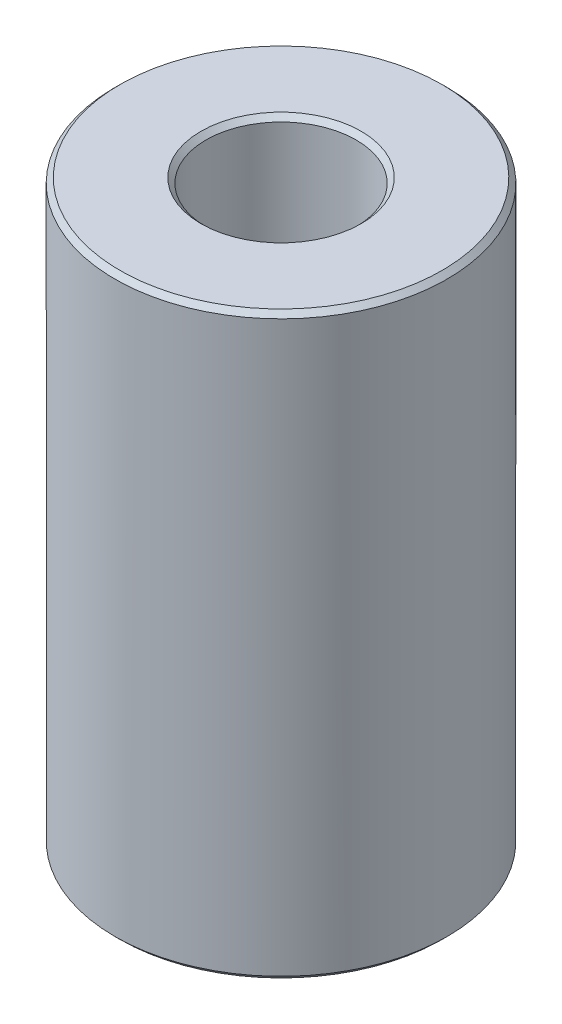
ISO-10303-21;
HEADER;
FILE_DESCRIPTION(('STEP AP214'),'2;1');
FILE_NAME('part.step','',(''),(''),'','','');
FILE_SCHEMA(('AUTOMOTIVE_DESIGN { 1 0 10303 214 1 1 1 1 }'));
ENDSEC;
DATA;
#1=APPLICATION_CONTEXT('core data for automotive mechanical design processes');
#2=APPLICATION_PROTOCOL_DEFINITION('international standard','automotive_design',2000,#1);
#3=PRODUCT_CONTEXT('',#1,'mechanical');
#4=PRODUCT('Part','Part','',(#3));
#5=PRODUCT_RELATED_PRODUCT_CATEGORY('part','',(#4));
#6=PRODUCT_DEFINITION_FORMATION('','',#4);
#7=PRODUCT_DEFINITION_CONTEXT('part definition',#1,'design');
#8=PRODUCT_DEFINITION('design','',#6,#7);
#9=PRODUCT_DEFINITION_SHAPE('','',#8);
#10=(LENGTH_UNIT() NAMED_UNIT(*) SI_UNIT(.MILLI.,.METRE.));
#11=(NAMED_UNIT(*) PLANE_ANGLE_UNIT() SI_UNIT($,.RADIAN.));
#12=(NAMED_UNIT(*) SI_UNIT($,.STERADIAN.) SOLID_ANGLE_UNIT());
#13=UNCERTAINTY_MEASURE_WITH_UNIT(LENGTH_MEASURE(1.E-05),#10,'distance_accuracy_value','');
#14=(GEOMETRIC_REPRESENTATION_CONTEXT(3) GLOBAL_UNCERTAINTY_ASSIGNED_CONTEXT((#13)) GLOBAL_UNIT_ASSIGNED_CONTEXT((#10,
#11,#12)) REPRESENTATION_CONTEXT('',''));
#15=CARTESIAN_POINT('',(0.,0.,0.));
#16=DIRECTION('',(0.,0.,1.));
#17=DIRECTION('',(1.,0.,0.));
#18=AXIS2_PLACEMENT_3D('',#15,#16,#17);
#19=CARTESIAN_POINT('',(0.,78.5007018334461,0.));
#20=DIRECTION('',(0.,-1.,0.));
#21=DIRECTION('',(0.,0.,-1.));
#22=AXIS2_PLACEMENT_3D('',#19,#20,#21);
#23=CYLINDRICAL_SURFACE('',#22,22.5);
#24=CARTESIAN_POINT('',(0.,0.679007585062105,0.));
#25=DIRECTION('',(0.,1.,0.));
#26=DIRECTION('',(0.,0.,1.));
#27=AXIS2_PLACEMENT_3D('',#24,#25,#26);
#28=CIRCLE('',#27,22.5);
#29=CARTESIAN_POINT('',(0.,0.679007585062091,-22.5));
#30=VERTEX_POINT('',#29);
#31=EDGE_CURVE('E10',#30,#30,#28,.T.);
#32=CARTESIAN_POINT('',(0.,77.8216942483841,0.));
#33=DIRECTION('',(0.,1.,0.));
#34=DIRECTION('',(0.,0.,1.));
#35=AXIS2_PLACEMENT_3D('',#32,#33,#34);
#36=CIRCLE('',#35,22.5);
#37=CARTESIAN_POINT('',(0.,77.8216942483841,-22.5));
#38=VERTEX_POINT('',#37);
#39=EDGE_CURVE('E50',#38,#38,#36,.F.);
#40=CARTESIAN_POINT('',(0.,0.679007585062091,-22.5));
#41=CARTESIAN_POINT('',(0.,1.48257723780503,-22.5));
#42=CARTESIAN_POINT('',(0.,2.28614689054797,-22.5));
#43=CARTESIAN_POINT('',(0.,3.89328619603384,-22.5));
#44=CARTESIAN_POINT('',(0.,4.69685584877678,-22.5));
#45=CARTESIAN_POINT('',(0.,6.30399515426266,-22.5));
#46=CARTESIAN_POINT('',(0.,7.10756480700559,-22.5));
#47=CARTESIAN_POINT('',(0.,8.71470411249147,-22.5));
#48=CARTESIAN_POINT('',(0.,9.51827376523441,-22.5));
#49=CARTESIAN_POINT('',(0.,11.1254130707203,-22.5));
#50=CARTESIAN_POINT('',(0.,11.9289827234632,-22.5));
#51=CARTESIAN_POINT('',(0.,13.5361220289491,-22.5));
#52=CARTESIAN_POINT('',(0.,14.339691681692,-22.5));
#53=CARTESIAN_POINT('',(0.,15.9468309871779,-22.5));
#54=CARTESIAN_POINT('',(0.,16.7504006399208,-22.5));
#55=CARTESIAN_POINT('',(0.,18.3575399454067,-22.5));
#56=CARTESIAN_POINT('',(0.,19.1611095981497,-22.5));
#57=CARTESIAN_POINT('',(0.,20.7682489036355,-22.5));
#58=CARTESIAN_POINT('',(0.,21.5718185563785,-22.5));
#59=CARTESIAN_POINT('',(0.,23.1789578618643,-22.5));
#60=CARTESIAN_POINT('',(0.,23.9825275146073,-22.5));
#61=CARTESIAN_POINT('',(0.,25.5896668200932,-22.5));
#62=CARTESIAN_POINT('',(0.,26.3932364728361,-22.5));
#63=CARTESIAN_POINT('',(0.,28.000375778322,-22.5));
#64=CARTESIAN_POINT('',(0.,28.8039454310649,-22.5));
#65=CARTESIAN_POINT('',(0.,30.4110847365508,-22.5));
#66=CARTESIAN_POINT('',(0.,31.2146543892937,-22.5));
#67=CARTESIAN_POINT('',(0.,32.8217936947796,-22.5));
#68=CARTESIAN_POINT('',(0.,33.6253633475225,-22.5));
#69=CARTESIAN_POINT('',(0.,35.2325026530084,-22.5));
#70=CARTESIAN_POINT('',(0.,36.0360723057514,-22.5));
#71=CARTESIAN_POINT('',(0.,37.6432116112372,-22.5));
#72=CARTESIAN_POINT('',(0.,38.4467812639802,-22.5));
#73=CARTESIAN_POINT('',(0.,40.0539205694661,-22.5));
#74=CARTESIAN_POINT('',(0.,40.857490222209,-22.5));
#75=CARTESIAN_POINT('',(0.,42.4646295276949,-22.5));
#76=CARTESIAN_POINT('',(0.,43.2681991804378,-22.5));
#77=CARTESIAN_POINT('',(0.,44.8753384859237,-22.5));
#78=CARTESIAN_POINT('',(0.,45.6789081386666,-22.5));
#79=CARTESIAN_POINT('',(0.,47.2860474441525,-22.5));
#80=CARTESIAN_POINT('',(0.,48.0896170968954,-22.5));
#81=CARTESIAN_POINT('',(0.,49.6967564023813,-22.5));
#82=CARTESIAN_POINT('',(0.,50.5003260551242,-22.5));
#83=CARTESIAN_POINT('',(0.,52.1074653606101,-22.5));
#84=CARTESIAN_POINT('',(0.,52.9110350133531,-22.5));
#85=CARTESIAN_POINT('',(0.,54.5181743188389,-22.5));
#86=CARTESIAN_POINT('',(0.,55.3217439715819,-22.5));
#87=CARTESIAN_POINT('',(0.,56.9288832770677,-22.5));
#88=CARTESIAN_POINT('',(0.,57.7324529298107,-22.5));
#89=CARTESIAN_POINT('',(0.,59.3395922352966,-22.5));
#90=CARTESIAN_POINT('',(0.,60.1431618880395,-22.5));
#91=CARTESIAN_POINT('',(0.,61.7503011935254,-22.5));
#92=CARTESIAN_POINT('',(0.,62.5538708462683,-22.5));
#93=CARTESIAN_POINT('',(0.,64.1610101517542,-22.5));
#94=CARTESIAN_POINT('',(0.,64.9645798044971,-22.5));
#95=CARTESIAN_POINT('',(0.,66.571719109983,-22.5));
#96=CARTESIAN_POINT('',(0.,67.3752887627259,-22.5));
#97=CARTESIAN_POINT('',(0.,68.9824280682118,-22.5));
#98=CARTESIAN_POINT('',(0.,69.7859977209548,-22.5));
#99=CARTESIAN_POINT('',(0.,71.3931370264406,-22.5));
#100=CARTESIAN_POINT('',(0.,72.1967066791836,-22.5));
#101=CARTESIAN_POINT('',(0.,73.8038459846694,-22.5));
#102=CARTESIAN_POINT('',(0.,74.6074156374124,-22.5));
#103=CARTESIAN_POINT('',(0.,76.2145549428982,-22.5));
#104=CARTESIAN_POINT('',(0.,77.0181245956412,-22.5));
#105=CARTESIAN_POINT('',(0.,77.8216942483841,-22.5));
#106=B_SPLINE_CURVE_WITH_KNOTS('',3,(#40,#41,#42,#43,#44,#45,#46,#47,#48,#49,#50,#51,#52,#53,
#54,#55,#56,#57,#58,#59,#60,#61,#62,#63,#64,#65,#66,#67,#68,#69,#70,#71,#72,#73,#74,#75,#76,#77,
#78,#79,#80,#81,#82,#83,#84,#85,#86,#87,#88,#89,#90,#91,#92,#93,#94,#95,#96,#97,#98,#99,#100,
#101,#102,#103,#104,#105),.UNSPECIFIED.,.F.,.F.,(4,2,2,2,2,2,2,2,2,2,2,2,2,2,2,2,2,2,2,2,2,2,2,
2,2,2,2,2,2,2,2,2,4),(0.,2.41070895822881,4.82141791645763,7.23212687468644,9.64283583291525,
12.0535447911441,14.4642537493729,16.8749627076017,19.2856716658305,21.6963806240593,
24.1070895822881,26.517798540517,28.9285074987458,31.3392164569746,33.7499254152034,
36.1606343734322,38.571343331661,40.9820522898898,43.3927612481186,45.8034702063475,
48.2141791645763,50.6248881228051,53.0355970810339,55.4463060392627,57.8570149974915,
60.2677239557203,62.6784329139492,65.089141872178,67.4998508304068,69.9105597886356,
72.3212687468644,74.7319777050932,77.142686663322),.UNSPECIFIED.);
#107=EDGE_CURVE('BSEAM39',#30,#38,#106,.T.);
#108=ORIENTED_EDGE('',*,*,#31,.T.);
#109=ORIENTED_EDGE('',*,*,#39,.T.);
#110=ORIENTED_EDGE('',*,*,#107,.T.);
#111=ORIENTED_EDGE('',*,*,#107,.F.);
#112=EDGE_LOOP('',(#108,#110,#109,#111));
#113=FACE_BOUND('',#112,.T.);
#114=ADVANCED_FACE('F39',(#113),#23,.T.);
#115=CARTESIAN_POINT('',(0.,78.5007018334461,0.));
#116=DIRECTION('',(0.,1.,0.));
#117=DIRECTION('',(0.,0.,1.));
#118=AXIS2_PLACEMENT_3D('',#115,#116,#117);
#119=PLANE('',#118);
#120=CARTESIAN_POINT('',(0.,78.5007018334461,0.));
#121=DIRECTION('',(0.,1.,0.));
#122=DIRECTION('',(0.,0.,1.));
#123=AXIS2_PLACEMENT_3D('',#120,#121,#122);
#124=CIRCLE('',#123,10.8547669646101);
#125=CARTESIAN_POINT('',(0.,78.5007018334461,10.8547669646101));
#126=VERTEX_POINT('',#125);
#127=EDGE_CURVE('E58',#126,#126,#124,.F.);
#128=ORIENTED_EDGE('',*,*,#127,.T.);
#129=EDGE_LOOP('',(#128));
#130=FACE_BOUND('',#129,.T.);
#131=CARTESIAN_POINT('',(0.,78.5007018334461,0.));
#132=DIRECTION('',(0.,1.,0.));
#133=DIRECTION('',(0.,0.,1.));
#134=AXIS2_PLACEMENT_3D('',#131,#132,#133);
#135=CIRCLE('',#134,21.820992414938);
#136=CARTESIAN_POINT('',(0.,78.5007018334461,-21.820992414938));
#137=VERTEX_POINT('',#136);
#138=EDGE_CURVE('E61',#137,#137,#135,.T.);
#139=ORIENTED_EDGE('',*,*,#138,.T.);
#140=EDGE_LOOP('',(#139));
#141=FACE_BOUND('',#140,.T.);
#142=ADVANCED_FACE('F88',(#130,#141),#119,.T.);
#143=CARTESIAN_POINT('',(0.,0.,0.));
#144=DIRECTION('',(0.,1.,0.));
#145=DIRECTION('',(0.,0.,1.));
#146=AXIS2_PLACEMENT_3D('',#143,#144,#145);
#147=PLANE('',#146);
#148=CARTESIAN_POINT('',(0.,0.,0.));
#149=DIRECTION('',(0.,1.,0.));
#150=DIRECTION('',(0.,0.,1.));
#151=AXIS2_PLACEMENT_3D('',#148,#149,#150);
#152=CIRCLE('',#151,10.8547669646101);
#153=CARTESIAN_POINT('',(0.,0.,10.8547669646101));
#154=VERTEX_POINT('',#153);
#155=EDGE_CURVE('E51',#154,#154,#152,.T.);
#156=ORIENTED_EDGE('',*,*,#155,.T.);
#157=EDGE_LOOP('',(#156));
#158=FACE_BOUND('',#157,.T.);
#159=CARTESIAN_POINT('',(0.,0.,0.));
#160=DIRECTION('',(0.,1.,0.));
#161=DIRECTION('',(0.,0.,1.));
#162=AXIS2_PLACEMENT_3D('',#159,#160,#161);
#163=CIRCLE('',#162,21.8209924149379);
#164=CARTESIAN_POINT('',(0.,0.,21.8209924149379));
#165=VERTEX_POINT('',#164);
#166=EDGE_CURVE('E54',#165,#165,#163,.F.);
#167=ORIENTED_EDGE('',*,*,#166,.T.);
#168=EDGE_LOOP('',(#167));
#169=FACE_BOUND('',#168,.T.);
#170=ADVANCED_FACE('F83',(#158,#169),#147,.F.);
#171=CARTESIAN_POINT('',(0.,78.5007018334461,0.));
#172=DIRECTION('',(0.,-1.,0.));
#173=DIRECTION('',(0.,0.,-1.));
#174=AXIS2_PLACEMENT_3D('',#171,#172,#173);
#175=CYLINDRICAL_SURFACE('',#174,10.175759379548);
#176=CARTESIAN_POINT('',(0.,77.821694248384,0.));
#177=DIRECTION('',(0.,1.,0.));
#178=DIRECTION('',(0.,0.,1.));
#179=AXIS2_PLACEMENT_3D('',#176,#177,#178);
#180=CIRCLE('',#179,10.175759379548);
#181=CARTESIAN_POINT('',(0.,77.821694248384,-10.175759379548));
#182=VERTEX_POINT('',#181);
#183=EDGE_CURVE('E67',#182,#182,#180,.T.);
#184=CARTESIAN_POINT('',(0.,0.679007585062008,0.));
#185=DIRECTION('',(0.,1.,0.));
#186=DIRECTION('',(0.,0.,1.));
#187=AXIS2_PLACEMENT_3D('',#184,#185,#186);
#188=CIRCLE('',#187,10.175759379548);
#189=CARTESIAN_POINT('',(0.,0.679007585062008,-10.175759379548));
#190=VERTEX_POINT('',#189);
#191=EDGE_CURVE('E69',#190,#190,#188,.F.);
#192=CARTESIAN_POINT('',(0.,77.821694248384,-10.175759379548));
#193=CARTESIAN_POINT('',(0.,77.0181245956411,-10.175759379548));
#194=CARTESIAN_POINT('',(0.,76.2145549428981,-10.175759379548));
#195=CARTESIAN_POINT('',(0.,74.6074156374123,-10.175759379548));
#196=CARTESIAN_POINT('',(0.,73.8038459846693,-10.175759379548));
#197=CARTESIAN_POINT('',(0.,72.1967066791834,-10.175759379548));
#198=CARTESIAN_POINT('',(0.,71.3931370264405,-10.175759379548));
#199=CARTESIAN_POINT('',(0.,69.7859977209546,-10.175759379548));
#200=CARTESIAN_POINT('',(0.,68.9824280682117,-10.175759379548));
#201=CARTESIAN_POINT('',(0.,67.3752887627258,-10.175759379548));
#202=CARTESIAN_POINT('',(0.,66.5717191099829,-10.175759379548));
#203=CARTESIAN_POINT('',(0.,64.964579804497,-10.175759379548));
#204=CARTESIAN_POINT('',(0.,64.1610101517541,-10.175759379548));
#205=CARTESIAN_POINT('',(0.,62.5538708462682,-10.175759379548));
#206=CARTESIAN_POINT('',(0.,61.7503011935253,-10.175759379548));
#207=CARTESIAN_POINT('',(0.,60.1431618880394,-10.175759379548));
#208=CARTESIAN_POINT('',(0.,59.3395922352964,-10.175759379548));
#209=CARTESIAN_POINT('',(0.,57.7324529298106,-10.175759379548));
#210=CARTESIAN_POINT('',(0.,56.9288832770676,-10.175759379548));
#211=CARTESIAN_POINT('',(0.,55.3217439715817,-10.175759379548));
#212=CARTESIAN_POINT('',(0.,54.5181743188388,-10.175759379548));
#213=CARTESIAN_POINT('',(0.,52.9110350133529,-10.175759379548));
#214=CARTESIAN_POINT('',(0.,52.10746536061,-10.175759379548));
#215=CARTESIAN_POINT('',(0.,50.5003260551241,-10.175759379548));
#216=CARTESIAN_POINT('',(0.,49.6967564023812,-10.175759379548));
#217=CARTESIAN_POINT('',(0.,48.0896170968953,-10.175759379548));
#218=CARTESIAN_POINT('',(0.,47.2860474441524,-10.175759379548));
#219=CARTESIAN_POINT('',(0.,45.6789081386665,-10.175759379548));
#220=CARTESIAN_POINT('',(0.,44.8753384859236,-10.175759379548));
#221=CARTESIAN_POINT('',(0.,43.2681991804377,-10.175759379548));
#222=CARTESIAN_POINT('',(0.,42.4646295276948,-10.175759379548));
#223=CARTESIAN_POINT('',(0.,40.8574902222089,-10.175759379548));
#224=CARTESIAN_POINT('',(0.,40.0539205694659,-10.175759379548));
#225=CARTESIAN_POINT('',(0.,38.4467812639801,-10.175759379548));
#226=CARTESIAN_POINT('',(0.,37.6432116112371,-10.175759379548));
#227=CARTESIAN_POINT('',(0.,36.0360723057513,-10.175759379548));
#228=CARTESIAN_POINT('',(0.,35.2325026530083,-10.175759379548));
#229=CARTESIAN_POINT('',(0.,33.6253633475224,-10.175759379548));
#230=CARTESIAN_POINT('',(0.,32.8217936947795,-10.175759379548));
#231=CARTESIAN_POINT('',(0.,31.2146543892936,-10.175759379548));
#232=CARTESIAN_POINT('',(0.,30.4110847365507,-10.175759379548));
#233=CARTESIAN_POINT('',(0.,28.8039454310648,-10.175759379548));
#234=CARTESIAN_POINT('',(0.,28.0003757783219,-10.175759379548));
#235=CARTESIAN_POINT('',(0.,26.393236472836,-10.175759379548));
#236=CARTESIAN_POINT('',(0.,25.5896668200931,-10.175759379548));
#237=CARTESIAN_POINT('',(0.,23.9825275146072,-10.175759379548));
#238=CARTESIAN_POINT('',(0.,23.1789578618643,-10.175759379548));
#239=CARTESIAN_POINT('',(0.,21.5718185563784,-10.175759379548));
#240=CARTESIAN_POINT('',(0.,20.7682489036354,-10.175759379548));
#241=CARTESIAN_POINT('',(0.,19.1611095981496,-10.175759379548));
#242=CARTESIAN_POINT('',(0.,18.3575399454066,-10.175759379548));
#243=CARTESIAN_POINT('',(0.,16.7504006399208,-10.175759379548));
#244=CARTESIAN_POINT('',(0.,15.9468309871778,-10.175759379548));
#245=CARTESIAN_POINT('',(0.,14.3396916816919,-10.175759379548));
#246=CARTESIAN_POINT('',(0.,13.536122028949,-10.175759379548));
#247=CARTESIAN_POINT('',(0.,11.9289827234631,-10.175759379548));
#248=CARTESIAN_POINT('',(0.,11.1254130707202,-10.175759379548));
#249=CARTESIAN_POINT('',(0.,9.51827376523432,-10.175759379548));
#250=CARTESIAN_POINT('',(0.,8.71470411249139,-10.175759379548));
#251=CARTESIAN_POINT('',(0.,7.10756480700551,-10.175759379548));
#252=CARTESIAN_POINT('',(0.,6.30399515426257,-10.175759379548));
#253=CARTESIAN_POINT('',(0.,4.6968558487767,-10.175759379548));
#254=CARTESIAN_POINT('',(0.,3.89328619603376,-10.175759379548));
#255=CARTESIAN_POINT('',(0.,2.28614689054788,-10.175759379548));
#256=CARTESIAN_POINT('',(0.,1.48257723780495,-10.175759379548));
#257=CARTESIAN_POINT('',(0.,0.679007585062008,-10.175759379548));
#258=B_SPLINE_CURVE_WITH_KNOTS('',3,(#192,#193,#194,#195,#196,#197,#198,#199,#200,#201,#202,
#203,#204,#205,#206,#207,#208,#209,#210,#211,#212,#213,#214,#215,#216,#217,#218,#219,#220,#221,
#222,#223,#224,#225,#226,#227,#228,#229,#230,#231,#232,#233,#234,#235,#236,#237,#238,#239,#240,
#241,#242,#243,#244,#245,#246,#247,#248,#249,#250,#251,#252,#253,#254,#255,#256,#257),
.UNSPECIFIED.,.F.,.F.,(4,2,2,2,2,2,2,2,2,2,2,2,2,2,2,2,2,2,2,2,2,2,2,2,2,2,2,2,2,2,2,2,4),(0.,
2.4107089582288,4.82141791645761,7.23212687468643,9.64283583291524,12.0535447911441,
14.4642537493729,16.8749627076017,19.2856716658305,21.6963806240593,24.1070895822881,
26.5177985405169,28.9285074987457,31.3392164569745,33.7499254152034,36.1606343734322,
38.571343331661,40.9820522898898,43.3927612481186,45.8034702063474,48.2141791645762,
50.624888122805,53.0355970810339,55.4463060392627,57.8570149974915,60.2677239557203,
62.6784329139491,65.0891418721779,67.4998508304067,69.9105597886355,72.3212687468644,
74.7319777050932,77.142686663322),.UNSPECIFIED.);
#259=EDGE_CURVE('BSEAM71',#182,#190,#258,.T.);
#260=ORIENTED_EDGE('',*,*,#183,.T.);
#261=ORIENTED_EDGE('',*,*,#191,.T.);
#262=ORIENTED_EDGE('',*,*,#259,.T.);
#263=ORIENTED_EDGE('',*,*,#259,.F.);
#264=EDGE_LOOP('',(#260,#262,#261,#263));
#265=FACE_BOUND('',#264,.T.);
#266=ADVANCED_FACE('F71',(#265),#175,.F.);
#267=CARTESIAN_POINT('',(0.,77.821694248384,0.));
#268=DIRECTION('',(0.,1.,0.));
#269=DIRECTION('',(0.,0.,1.));
#270=AXIS2_PLACEMENT_3D('',#267,#268,#269);
#271=CONICAL_SURFACE('',#270,10.175759379548,0.785398163397452);
#272=ORIENTED_EDGE('',*,*,#127,.F.);
#273=EDGE_LOOP('',(#272));
#274=FACE_BOUND('',#273,.T.);
#275=ORIENTED_EDGE('',*,*,#183,.F.);
#276=EDGE_LOOP('',(#275));
#277=FACE_BOUND('',#276,.T.);
#278=ADVANCED_FACE('F77',(#274,#277),#271,.F.);
#279=CARTESIAN_POINT('',(0.,0.,0.));
#280=DIRECTION('',(0.,-1.,0.));
#281=DIRECTION('',(0.,0.,-1.));
#282=AXIS2_PLACEMENT_3D('',#279,#280,#281);
#283=CONICAL_SURFACE('',#282,10.8547669646101,0.785398163397447);
#284=ORIENTED_EDGE('',*,*,#191,.F.);
#285=EDGE_LOOP('',(#284));
#286=FACE_BOUND('',#285,.T.);
#287=ORIENTED_EDGE('',*,*,#155,.F.);
#288=EDGE_LOOP('',(#287));
#289=FACE_BOUND('',#288,.T.);
#290=ADVANCED_FACE('F73',(#286,#289),#283,.F.);
#291=CARTESIAN_POINT('',(0.,0.679007585062105,0.));
#292=DIRECTION('',(0.,1.,0.));
#293=DIRECTION('',(0.,0.,1.));
#294=AXIS2_PLACEMENT_3D('',#291,#292,#293);
#295=CONICAL_SURFACE('',#294,22.5,0.785398163397453);
#296=ORIENTED_EDGE('',*,*,#166,.F.);
#297=EDGE_LOOP('',(#296));
#298=FACE_BOUND('',#297,.T.);
#299=ORIENTED_EDGE('',*,*,#31,.F.);
#300=EDGE_LOOP('',(#299));
#301=FACE_BOUND('',#300,.T.);
#302=ADVANCED_FACE('F76',(#298,#301),#295,.T.);
#303=CARTESIAN_POINT('',(0.,78.5007018334461,0.));
#304=DIRECTION('',(0.,-1.,0.));
#305=DIRECTION('',(0.,0.,-1.));
#306=AXIS2_PLACEMENT_3D('',#303,#304,#305);
#307=CONICAL_SURFACE('',#306,21.820992414938,0.785398163397459);
#308=CARTESIAN_POINT('',(0.,77.8216942483841,-22.5));
#309=CARTESIAN_POINT('',(0.,77.8287672440619,-22.4929270043223));
#310=CARTESIAN_POINT('',(0.,77.8358402397396,-22.4858540086446));
#311=CARTESIAN_POINT('',(0.,77.849986231095,-22.4717080172891));
#312=CARTESIAN_POINT('',(0.,77.8570592267728,-22.4646350216114));
#313=CARTESIAN_POINT('',(0.,77.8712052181282,-22.4504890302559));
#314=CARTESIAN_POINT('',(0.,77.878278213806,-22.4434160345782));
#315=CARTESIAN_POINT('',(0.,77.8924242051614,-22.4292700432227));
#316=CARTESIAN_POINT('',(0.,77.8994972008391,-22.422197047545));
#317=CARTESIAN_POINT('',(0.,77.9136431921946,-22.4080510561895));
#318=CARTESIAN_POINT('',(0.,77.9207161878723,-22.4009780605118));
#319=CARTESIAN_POINT('',(0.,77.9348621792278,-22.3868320691563));
#320=CARTESIAN_POINT('',(0.,77.9419351749055,-22.3797590734786));
#321=CARTESIAN_POINT('',(0.,77.956081166261,-22.3656130821232));
#322=CARTESIAN_POINT('',(0.,77.9631541619387,-22.3585400864454));
#323=CARTESIAN_POINT('',(0.,77.9773001532942,-22.34439409509));
#324=CARTESIAN_POINT('',(0.,77.9843731489719,-22.3373210994123));
#325=CARTESIAN_POINT('',(0.,77.9985191403273,-22.3231751080568));
#326=CARTESIAN_POINT('',(0.,78.0055921360051,-22.3161021123791));
#327=CARTESIAN_POINT('',(0.,78.0197381273605,-22.3019561210236));
#328=CARTESIAN_POINT('',(0.,78.0268111230382,-22.2948831253459));
#329=CARTESIAN_POINT('',(0.,78.0409571143937,-22.2807371339904));
#330=CARTESIAN_POINT('',(0.,78.0480301100714,-22.2736641383127));
#331=CARTESIAN_POINT('',(0.,78.0621761014269,-22.2595181469572));
#332=CARTESIAN_POINT('',(0.,78.0692490971046,-22.2524451512795));
#333=CARTESIAN_POINT('',(0.,78.0833950884601,-22.238299159924));
#334=CARTESIAN_POINT('',(0.,78.0904680841378,-22.2312261642463));
#335=CARTESIAN_POINT('',(0.,78.1046140754933,-22.2170801728909));
#336=CARTESIAN_POINT('',(0.,78.111687071171,-22.2100071772131));
#337=CARTESIAN_POINT('',(0.,78.1258330625265,-22.1958611858577));
#338=CARTESIAN_POINT('',(0.,78.1329060582042,-22.1887881901799));
#339=CARTESIAN_POINT('',(0.,78.1470520495596,-22.1746421988245));
#340=CARTESIAN_POINT('',(0.,78.1541250452374,-22.1675692031468));
#341=CARTESIAN_POINT('',(0.,78.1682710365928,-22.1534232117913));
#342=CARTESIAN_POINT('',(0.,78.1753440322706,-22.1463502161136));
#343=CARTESIAN_POINT('',(0.,78.189490023626,-22.1322042247581));
#344=CARTESIAN_POINT('',(0.,78.1965630193037,-22.1251312290804));
#345=CARTESIAN_POINT('',(0.,78.2107090106592,-22.1109852377249));
#346=CARTESIAN_POINT('',(0.,78.2177820063369,-22.1039122420472));
#347=CARTESIAN_POINT('',(0.,78.2319279976924,-22.0897662506917));
#348=CARTESIAN_POINT('',(0.,78.2390009933701,-22.082693255014));
#349=CARTESIAN_POINT('',(0.,78.2531469847256,-22.0685472636586));
#350=CARTESIAN_POINT('',(0.,78.2602199804033,-22.0614742679808));
#351=CARTESIAN_POINT('',(0.,78.2743659717588,-22.0473282766254));
#352=CARTESIAN_POINT('',(0.,78.2814389674365,-22.0402552809476));
#353=CARTESIAN_POINT('',(0.,78.2955849587919,-22.0261092895922));
#354=CARTESIAN_POINT('',(0.,78.3026579544697,-22.0190362939144));
#355=CARTESIAN_POINT('',(0.,78.3168039458251,-22.004890302559));
#356=CARTESIAN_POINT('',(0.,78.3238769415029,-21.9978173068813));
#357=CARTESIAN_POINT('',(0.,78.3380229328583,-21.9836713155258));
#358=CARTESIAN_POINT('',(0.,78.345095928536,-21.9765983198481));
#359=CARTESIAN_POINT('',(0.,78.3592419198915,-21.9624523284926));
#360=CARTESIAN_POINT('',(0.,78.3663149155692,-21.9553793328149));
#361=CARTESIAN_POINT('',(0.,78.3804609069247,-21.9412333414594));
#362=CARTESIAN_POINT('',(0.,78.3875339026024,-21.9341603457817));
#363=CARTESIAN_POINT('',(0.,78.4016798939579,-21.9200143544262));
#364=CARTESIAN_POINT('',(0.,78.4087528896356,-21.9129413587485));
#365=CARTESIAN_POINT('',(0.,78.4228988809911,-21.8987953673931));
#366=CARTESIAN_POINT('',(0.,78.4299718766688,-21.8917223717153));
#367=CARTESIAN_POINT('',(0.,78.4441178680243,-21.8775763803599));
#368=CARTESIAN_POINT('',(0.,78.451190863702,-21.8705033846821));
#369=CARTESIAN_POINT('',(0.,78.4653368550574,-21.8563573933267));
#370=CARTESIAN_POINT('',(0.,78.4724098507352,-21.849284397649));
#371=CARTESIAN_POINT('',(0.,78.4865558420906,-21.8351384062935));
#372=CARTESIAN_POINT('',(0.,78.4936288377684,-21.8280654106158));
#373=CARTESIAN_POINT('',(0.,78.5007018334461,-21.820992414938));
#374=B_SPLINE_CURVE_WITH_KNOTS('',3,(#308,#309,#310,#311,#312,#313,#314,#315,#316,#317,#318,
#319,#320,#321,#322,#323,#324,#325,#326,#327,#328,#329,#330,#331,#332,#333,#334,#335,#336,#337,
#338,#339,#340,#341,#342,#343,#344,#345,#346,#347,#348,#349,#350,#351,#352,#353,#354,#355,#356,
#357,#358,#359,#360,#361,#362,#363,#364,#365,#366,#367,#368,#369,#370,#371,#372,#373),
.UNSPECIFIED.,.F.,.F.,(4,2,2,2,2,2,2,2,2,2,2,2,2,2,2,2,2,2,2,2,2,2,2,2,2,2,2,2,2,2,2,2,4),(0.,
0.0300081792421481,0.0600163584842937,0.0900245377264515,0.120032716968597,0.150040896210745,
0.180049075452903,0.210057254695049,0.240065433937207,0.270073613179355,0.3000817924215,
0.330089971663658,0.360098150905804,0.390106330147952,0.42011450939011,0.450122688632255,
0.480130867874413,0.510139047116561,0.540147226358707,0.570155405600865,0.60016358484301,
0.630171764085158,0.660179943327316,0.690188122569462,0.72019630181162,0.750204481053768,
0.780212660295913,0.810220839538071,0.840229018780217,0.870237198022365,0.900245377264523,
0.930253556506668,0.960261735748826),.UNSPECIFIED.);
#375=EDGE_CURVE('BSEAM45',#38,#137,#374,.T.);
#376=ORIENTED_EDGE('',*,*,#39,.F.);
#377=ORIENTED_EDGE('',*,*,#138,.F.);
#378=ORIENTED_EDGE('',*,*,#375,.T.);
#379=ORIENTED_EDGE('',*,*,#375,.F.);
#380=EDGE_LOOP('',(#376,#378,#377,#379));
#381=FACE_BOUND('',#380,.T.);
#382=ADVANCED_FACE('F45',(#381),#307,.T.);
#383=CLOSED_SHELL('',(#114,#142,#170,#266,#278,#290,#302,#382));
#384=MANIFOLD_SOLID_BREP('B2',#383);
#385=ADVANCED_BREP_SHAPE_REPRESENTATION('',(#18,#384),#14);
#386=SHAPE_DEFINITION_REPRESENTATION(#9,#385);
ENDSEC;
END-ISO-10303-21;
